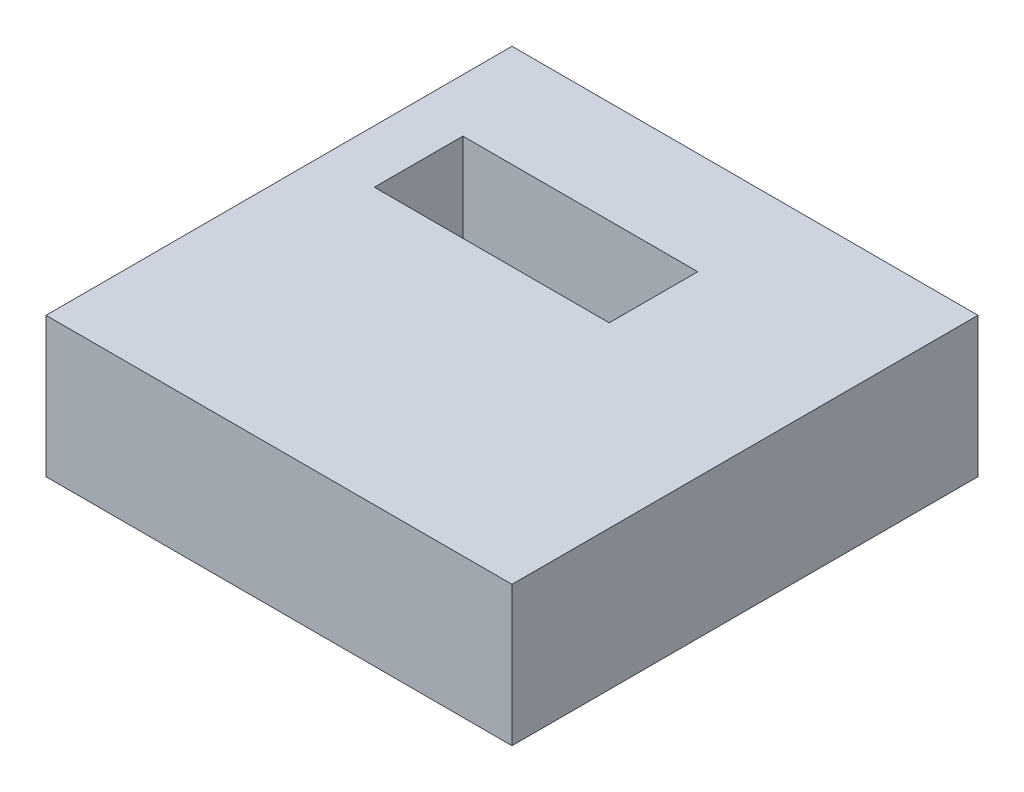
ISO-10303-21;
HEADER;
FILE_DESCRIPTION(('STEP AP214'),'2;1');
FILE_NAME('part.step','',(''),(''),'','','');
FILE_SCHEMA(('AUTOMOTIVE_DESIGN { 1 0 10303 214 1 1 1 1 }'));
ENDSEC;
DATA;
#1=APPLICATION_CONTEXT('core data for automotive mechanical design processes');
#2=APPLICATION_PROTOCOL_DEFINITION('international standard','automotive_design',2000,#1);
#3=PRODUCT_CONTEXT('',#1,'mechanical');
#4=PRODUCT('Part','Part','',(#3));
#5=PRODUCT_RELATED_PRODUCT_CATEGORY('part','',(#4));
#6=PRODUCT_DEFINITION_FORMATION('','',#4);
#7=PRODUCT_DEFINITION_CONTEXT('part definition',#1,'design');
#8=PRODUCT_DEFINITION('design','',#6,#7);
#9=PRODUCT_DEFINITION_SHAPE('','',#8);
#10=(LENGTH_UNIT() NAMED_UNIT(*) SI_UNIT(.MILLI.,.METRE.));
#11=(NAMED_UNIT(*) PLANE_ANGLE_UNIT() SI_UNIT($,.RADIAN.));
#12=(NAMED_UNIT(*) SI_UNIT($,.STERADIAN.) SOLID_ANGLE_UNIT());
#13=UNCERTAINTY_MEASURE_WITH_UNIT(LENGTH_MEASURE(1.E-05),#10,'distance_accuracy_value','');
#14=(GEOMETRIC_REPRESENTATION_CONTEXT(3) GLOBAL_UNCERTAINTY_ASSIGNED_CONTEXT((#13)) GLOBAL_UNIT_ASSIGNED_CONTEXT((#10,
#11,#12)) REPRESENTATION_CONTEXT('',''));
#15=CARTESIAN_POINT('',(0.,0.,0.));
#16=DIRECTION('',(0.,0.,1.));
#17=DIRECTION('',(1.,0.,0.));
#18=AXIS2_PLACEMENT_3D('',#15,#16,#17);
#19=CARTESIAN_POINT('',(0.,30.,0.));
#20=DIRECTION('',(0.,-1.,0.));
#21=DIRECTION('',(0.,0.,-1.));
#22=AXIS2_PLACEMENT_3D('',#19,#20,#21);
#23=PLANE('',#22);
#24=DIRECTION('',(0.,0.,-1.));
#25=VECTOR('',#24,1.);
#26=CARTESIAN_POINT('',(50.,30.,50.));
#27=LINE('',#26,#25);
#28=CARTESIAN_POINT('',(50.,30.,50.));
#29=VERTEX_POINT('',#28);
#30=CARTESIAN_POINT('',(50.,30.,-50.));
#31=VERTEX_POINT('',#30);
#32=EDGE_CURVE('E153',#29,#31,#27,.T.);
#33=ORIENTED_EDGE('',*,*,#32,.T.);
#34=DIRECTION('',(-1.,0.,0.));
#35=VECTOR('',#34,1.);
#36=CARTESIAN_POINT('',(-50.,30.,-50.));
#37=LINE('',#36,#35);
#38=CARTESIAN_POINT('',(-50.,30.,-50.));
#39=VERTEX_POINT('',#38);
#40=EDGE_CURVE('E157',#31,#39,#37,.T.);
#41=ORIENTED_EDGE('',*,*,#40,.T.);
#42=DIRECTION('',(0.,0.,1.));
#43=VECTOR('',#42,1.);
#44=CARTESIAN_POINT('',(-50.,30.,50.));
#45=LINE('',#44,#43);
#46=CARTESIAN_POINT('',(-50.,30.,50.));
#47=VERTEX_POINT('',#46);
#48=EDGE_CURVE('E161',#39,#47,#45,.T.);
#49=ORIENTED_EDGE('',*,*,#48,.T.);
#50=DIRECTION('',(1.,0.,0.));
#51=VECTOR('',#50,1.);
#52=CARTESIAN_POINT('',(-50.,30.,50.));
#53=LINE('',#52,#51);
#54=EDGE_CURVE('E164',#47,#29,#53,.T.);
#55=ORIENTED_EDGE('',*,*,#54,.T.);
#56=EDGE_LOOP('',(#33,#41,#49,#55));
#57=FACE_BOUND('',#56,.T.);
#58=DIRECTION('',(0.,0.,1.));
#59=VECTOR('',#58,1.);
#60=CARTESIAN_POINT('',(-38.57,30.,-28.03));
#61=LINE('',#60,#59);
#62=CARTESIAN_POINT('',(-38.57,30.,-28.03));
#63=VERTEX_POINT('',#62);
#64=CARTESIAN_POINT('',(-38.57,30.,-9.03));
#65=VERTEX_POINT('',#64);
#66=EDGE_CURVE('E105',#63,#65,#61,.T.);
#67=ORIENTED_EDGE('',*,*,#66,.F.);
#68=DIRECTION('',(-1.,0.,0.));
#69=VECTOR('',#68,1.);
#70=CARTESIAN_POINT('',(-38.57,30.,-28.03));
#71=LINE('',#70,#69);
#72=CARTESIAN_POINT('',(11.83,30.,-28.03));
#73=VERTEX_POINT('',#72);
#74=EDGE_CURVE('E131',#73,#63,#71,.T.);
#75=ORIENTED_EDGE('',*,*,#74,.F.);
#76=DIRECTION('',(0.,0.,-1.));
#77=VECTOR('',#76,1.);
#78=CARTESIAN_POINT('',(11.83,30.,-28.03));
#79=LINE('',#78,#77);
#80=CARTESIAN_POINT('',(11.83,30.,-9.03));
#81=VERTEX_POINT('',#80);
#82=EDGE_CURVE('E127',#81,#73,#79,.T.);
#83=ORIENTED_EDGE('',*,*,#82,.F.);
#84=DIRECTION('',(1.,0.,0.));
#85=VECTOR('',#84,1.);
#86=CARTESIAN_POINT('',(-38.57,30.,-9.03));
#87=LINE('',#86,#85);
#88=EDGE_CURVE('E114',#65,#81,#87,.T.);
#89=ORIENTED_EDGE('',*,*,#88,.F.);
#90=EDGE_LOOP('',(#67,#75,#83,#89));
#91=FACE_BOUND('',#90,.T.);
#92=ADVANCED_FACE('F39',(#57,#91),#23,.F.);
#93=CARTESIAN_POINT('',(0.,0.,0.));
#94=DIRECTION('',(0.,-1.,0.));
#95=DIRECTION('',(0.,0.,-1.));
#96=AXIS2_PLACEMENT_3D('',#93,#94,#95);
#97=PLANE('',#96);
#98=DIRECTION('',(0.,0.,-1.));
#99=VECTOR('',#98,1.);
#100=CARTESIAN_POINT('',(50.,0.,50.));
#101=LINE('',#100,#99);
#102=CARTESIAN_POINT('',(50.,0.,50.));
#103=VERTEX_POINT('',#102);
#104=CARTESIAN_POINT('',(50.,0.,-50.));
#105=VERTEX_POINT('',#104);
#106=EDGE_CURVE('E123',#103,#105,#101,.T.);
#107=ORIENTED_EDGE('',*,*,#106,.F.);
#108=DIRECTION('',(1.,0.,0.));
#109=VECTOR('',#108,1.);
#110=CARTESIAN_POINT('',(-50.,0.,50.));
#111=LINE('',#110,#109);
#112=CARTESIAN_POINT('',(-50.,0.,50.));
#113=VERTEX_POINT('',#112);
#114=EDGE_CURVE('E158',#113,#103,#111,.T.);
#115=ORIENTED_EDGE('',*,*,#114,.F.);
#116=DIRECTION('',(0.,0.,1.));
#117=VECTOR('',#116,1.);
#118=CARTESIAN_POINT('',(-50.,0.,50.));
#119=LINE('',#118,#117);
#120=CARTESIAN_POINT('',(-50.,0.,-50.));
#121=VERTEX_POINT('',#120);
#122=EDGE_CURVE('E174',#121,#113,#119,.T.);
#123=ORIENTED_EDGE('',*,*,#122,.F.);
#124=DIRECTION('',(-1.,0.,0.));
#125=VECTOR('',#124,1.);
#126=CARTESIAN_POINT('',(-50.,0.,-50.));
#127=LINE('',#126,#125);
#128=EDGE_CURVE('E171',#105,#121,#127,.T.);
#129=ORIENTED_EDGE('',*,*,#128,.F.);
#130=EDGE_LOOP('',(#107,#115,#123,#129));
#131=FACE_BOUND('',#130,.T.);
#132=DIRECTION('',(-1.,0.,0.));
#133=VECTOR('',#132,1.);
#134=CARTESIAN_POINT('',(-38.57,0.,-28.03));
#135=LINE('',#134,#133);
#136=CARTESIAN_POINT('',(11.83,0.,-28.03));
#137=VERTEX_POINT('',#136);
#138=CARTESIAN_POINT('',(-38.57,0.,-28.03));
#139=VERTEX_POINT('',#138);
#140=EDGE_CURVE('E115',#137,#139,#135,.T.);
#141=ORIENTED_EDGE('',*,*,#140,.T.);
#142=DIRECTION('',(0.,0.,1.));
#143=VECTOR('',#142,1.);
#144=CARTESIAN_POINT('',(-38.57,0.,-28.03));
#145=LINE('',#144,#143);
#146=CARTESIAN_POINT('',(-38.57,0.,-9.03));
#147=VERTEX_POINT('',#146);
#148=EDGE_CURVE('E63',#139,#147,#145,.T.);
#149=ORIENTED_EDGE('',*,*,#148,.T.);
#150=DIRECTION('',(1.,0.,0.));
#151=VECTOR('',#150,1.);
#152=CARTESIAN_POINT('',(-38.57,0.,-9.03));
#153=LINE('',#152,#151);
#154=CARTESIAN_POINT('',(11.83,0.,-9.03));
#155=VERTEX_POINT('',#154);
#156=EDGE_CURVE('E121',#147,#155,#153,.T.);
#157=ORIENTED_EDGE('',*,*,#156,.T.);
#158=DIRECTION('',(0.,0.,-1.));
#159=VECTOR('',#158,1.);
#160=CARTESIAN_POINT('',(11.83,0.,-28.03));
#161=LINE('',#160,#159);
#162=EDGE_CURVE('E140',#155,#137,#161,.T.);
#163=ORIENTED_EDGE('',*,*,#162,.T.);
#164=EDGE_LOOP('',(#141,#149,#157,#163));
#165=FACE_BOUND('',#164,.T.);
#166=ADVANCED_FACE('F197',(#131,#165),#97,.T.);
#167=CARTESIAN_POINT('',(50.,30.,50.));
#168=DIRECTION('',(-1.,0.,0.));
#169=DIRECTION('',(0.,0.,1.));
#170=AXIS2_PLACEMENT_3D('',#167,#168,#169);
#171=PLANE('',#170);
#172=ORIENTED_EDGE('',*,*,#106,.T.);
#173=DIRECTION('',(0.,-1.,0.));
#174=VECTOR('',#173,1.);
#175=CARTESIAN_POINT('',(50.,30.,-50.));
#176=LINE('',#175,#174);
#177=EDGE_CURVE('E11',#31,#105,#176,.T.);
#178=ORIENTED_EDGE('',*,*,#177,.F.);
#179=ORIENTED_EDGE('',*,*,#32,.F.);
#180=DIRECTION('',(0.,-1.,0.));
#181=VECTOR('',#180,1.);
#182=CARTESIAN_POINT('',(50.,30.,50.));
#183=LINE('',#182,#181);
#184=EDGE_CURVE('E167',#29,#103,#183,.T.);
#185=ORIENTED_EDGE('',*,*,#184,.T.);
#186=EDGE_LOOP('',(#172,#178,#179,#185));
#187=FACE_BOUND('',#186,.T.);
#188=ADVANCED_FACE('F41',(#187),#171,.F.);
#189=CARTESIAN_POINT('',(-50.,30.,-50.));
#190=DIRECTION('',(0.,0.,1.));
#191=DIRECTION('',(1.,0.,0.));
#192=AXIS2_PLACEMENT_3D('',#189,#190,#191);
#193=PLANE('',#192);
#194=ORIENTED_EDGE('',*,*,#128,.T.);
#195=DIRECTION('',(0.,-1.,0.));
#196=VECTOR('',#195,1.);
#197=CARTESIAN_POINT('',(-50.,30.,-50.));
#198=LINE('',#197,#196);
#199=EDGE_CURVE('E48',#39,#121,#198,.T.);
#200=ORIENTED_EDGE('',*,*,#199,.F.);
#201=ORIENTED_EDGE('',*,*,#40,.F.);
#202=ORIENTED_EDGE('',*,*,#177,.T.);
#203=EDGE_LOOP('',(#194,#200,#201,#202));
#204=FACE_BOUND('',#203,.T.);
#205=ADVANCED_FACE('F207',(#204),#193,.F.);
#206=CARTESIAN_POINT('',(-50.,30.,50.));
#207=DIRECTION('',(1.,0.,0.));
#208=DIRECTION('',(0.,0.,-1.));
#209=AXIS2_PLACEMENT_3D('',#206,#207,#208);
#210=PLANE('',#209);
#211=ORIENTED_EDGE('',*,*,#122,.T.);
#212=DIRECTION('',(0.,-1.,0.));
#213=VECTOR('',#212,1.);
#214=CARTESIAN_POINT('',(-50.,30.,50.));
#215=LINE('',#214,#213);
#216=EDGE_CURVE('E182',#47,#113,#215,.T.);
#217=ORIENTED_EDGE('',*,*,#216,.F.);
#218=ORIENTED_EDGE('',*,*,#48,.F.);
#219=ORIENTED_EDGE('',*,*,#199,.T.);
#220=EDGE_LOOP('',(#211,#217,#218,#219));
#221=FACE_BOUND('',#220,.T.);
#222=ADVANCED_FACE('F191',(#221),#210,.F.);
#223=CARTESIAN_POINT('',(-50.,30.,50.));
#224=DIRECTION('',(0.,0.,-1.));
#225=DIRECTION('',(-1.,0.,0.));
#226=AXIS2_PLACEMENT_3D('',#223,#224,#225);
#227=PLANE('',#226);
#228=ORIENTED_EDGE('',*,*,#114,.T.);
#229=ORIENTED_EDGE('',*,*,#184,.F.);
#230=ORIENTED_EDGE('',*,*,#54,.F.);
#231=ORIENTED_EDGE('',*,*,#216,.T.);
#232=EDGE_LOOP('',(#228,#229,#230,#231));
#233=FACE_BOUND('',#232,.T.);
#234=ADVANCED_FACE('F201',(#233),#227,.F.);
#235=CARTESIAN_POINT('',(-38.57,30.,-28.03));
#236=DIRECTION('',(1.,0.,0.));
#237=DIRECTION('',(0.,0.,-1.));
#238=AXIS2_PLACEMENT_3D('',#235,#236,#237);
#239=PLANE('',#238);
#240=ORIENTED_EDGE('',*,*,#148,.F.);
#241=DIRECTION('',(0.,-1.,0.));
#242=VECTOR('',#241,1.);
#243=CARTESIAN_POINT('',(-38.57,30.,-28.03));
#244=LINE('',#243,#242);
#245=EDGE_CURVE('E109',#63,#139,#244,.T.);
#246=ORIENTED_EDGE('',*,*,#245,.F.);
#247=ORIENTED_EDGE('',*,*,#66,.T.);
#248=DIRECTION('',(0.,-1.,0.));
#249=VECTOR('',#248,1.);
#250=CARTESIAN_POINT('',(-38.57,30.,-9.03));
#251=LINE('',#250,#249);
#252=EDGE_CURVE('E108',#65,#147,#251,.T.);
#253=ORIENTED_EDGE('',*,*,#252,.T.);
#254=EDGE_LOOP('',(#240,#246,#247,#253));
#255=FACE_BOUND('',#254,.T.);
#256=ADVANCED_FACE('F107',(#255),#239,.T.);
#257=CARTESIAN_POINT('',(-38.57,30.,-9.03));
#258=DIRECTION('',(0.,0.,-1.));
#259=DIRECTION('',(-1.,0.,0.));
#260=AXIS2_PLACEMENT_3D('',#257,#258,#259);
#261=PLANE('',#260);
#262=ORIENTED_EDGE('',*,*,#156,.F.);
#263=ORIENTED_EDGE('',*,*,#252,.F.);
#264=ORIENTED_EDGE('',*,*,#88,.T.);
#265=DIRECTION('',(0.,-1.,0.));
#266=VECTOR('',#265,1.);
#267=CARTESIAN_POINT('',(11.83,30.,-9.03));
#268=LINE('',#267,#266);
#269=EDGE_CURVE('E124',#81,#155,#268,.T.);
#270=ORIENTED_EDGE('',*,*,#269,.T.);
#271=EDGE_LOOP('',(#262,#263,#264,#270));
#272=FACE_BOUND('',#271,.T.);
#273=ADVANCED_FACE('F118',(#272),#261,.T.);
#274=CARTESIAN_POINT('',(11.83,30.,-28.03));
#275=DIRECTION('',(-1.,0.,0.));
#276=DIRECTION('',(0.,0.,1.));
#277=AXIS2_PLACEMENT_3D('',#274,#275,#276);
#278=PLANE('',#277);
#279=ORIENTED_EDGE('',*,*,#162,.F.);
#280=ORIENTED_EDGE('',*,*,#269,.F.);
#281=ORIENTED_EDGE('',*,*,#82,.T.);
#282=DIRECTION('',(0.,-1.,0.));
#283=VECTOR('',#282,1.);
#284=CARTESIAN_POINT('',(11.83,30.,-28.03));
#285=LINE('',#284,#283);
#286=EDGE_CURVE('E55',#73,#137,#285,.T.);
#287=ORIENTED_EDGE('',*,*,#286,.T.);
#288=EDGE_LOOP('',(#279,#280,#281,#287));
#289=FACE_BOUND('',#288,.T.);
#290=ADVANCED_FACE('F230',(#289),#278,.T.);
#291=CARTESIAN_POINT('',(-38.57,30.,-28.03));
#292=DIRECTION('',(0.,0.,1.));
#293=DIRECTION('',(1.,0.,0.));
#294=AXIS2_PLACEMENT_3D('',#291,#292,#293);
#295=PLANE('',#294);
#296=ORIENTED_EDGE('',*,*,#140,.F.);
#297=ORIENTED_EDGE('',*,*,#286,.F.);
#298=ORIENTED_EDGE('',*,*,#74,.T.);
#299=ORIENTED_EDGE('',*,*,#245,.T.);
#300=EDGE_LOOP('',(#296,#297,#298,#299));
#301=FACE_BOUND('',#300,.T.);
#302=ADVANCED_FACE('F234',(#301),#295,.T.);
#303=CLOSED_SHELL('',(#92,#166,#188,#205,#222,#234,#256,#273,#290,#302));
#304=MANIFOLD_SOLID_BREP('B2',#303);
#305=ADVANCED_BREP_SHAPE_REPRESENTATION('',(#18,#304),#14);
#306=SHAPE_DEFINITION_REPRESENTATION(#9,#305);
ENDSEC;
END-ISO-10303-21;
